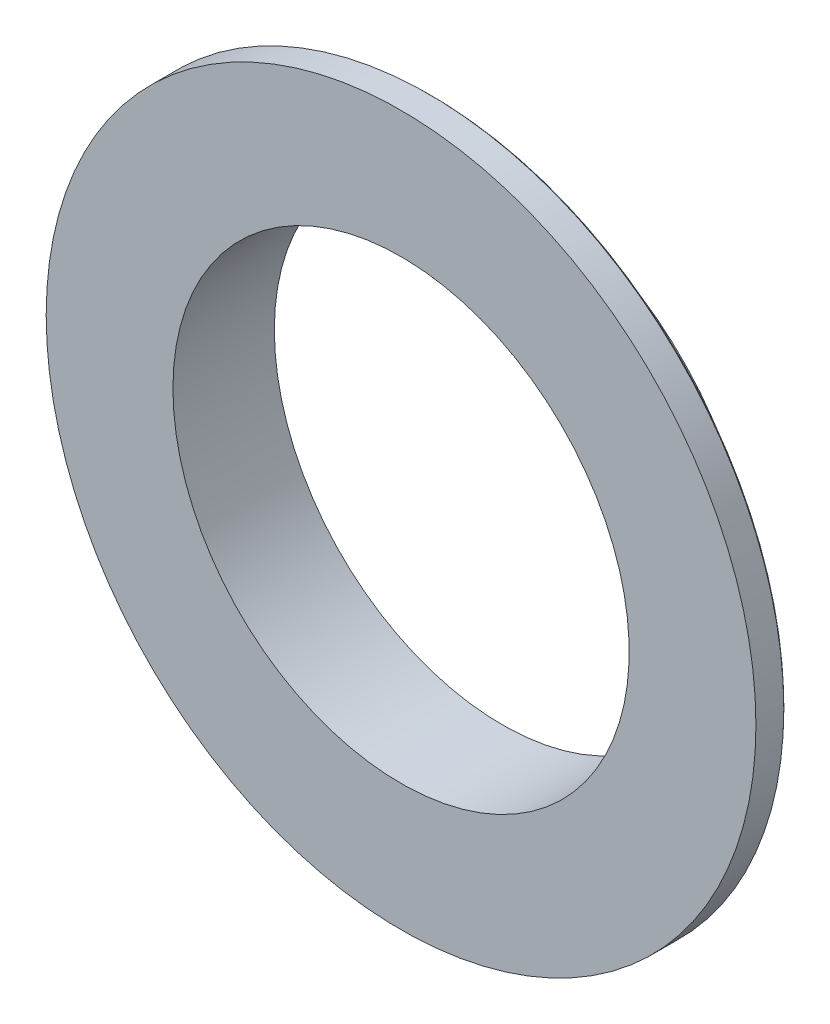
ISO-10303-21;
HEADER;
FILE_DESCRIPTION(('STEP AP214'),'2;1');
FILE_NAME('part.step','',(''),(''),'','','');
FILE_SCHEMA(('AUTOMOTIVE_DESIGN { 1 0 10303 214 1 1 1 1 }'));
ENDSEC;
DATA;
#1=APPLICATION_CONTEXT('core data for automotive mechanical design processes');
#2=APPLICATION_PROTOCOL_DEFINITION('international standard','automotive_design',2000,#1);
#3=PRODUCT_CONTEXT('',#1,'mechanical');
#4=PRODUCT('Part','Part','',(#3));
#5=PRODUCT_RELATED_PRODUCT_CATEGORY('part','',(#4));
#6=PRODUCT_DEFINITION_FORMATION('','',#4);
#7=PRODUCT_DEFINITION_CONTEXT('part definition',#1,'design');
#8=PRODUCT_DEFINITION('design','',#6,#7);
#9=PRODUCT_DEFINITION_SHAPE('','',#8);
#10=(LENGTH_UNIT() NAMED_UNIT(*) SI_UNIT(.MILLI.,.METRE.));
#11=(NAMED_UNIT(*) PLANE_ANGLE_UNIT() SI_UNIT($,.RADIAN.));
#12=(NAMED_UNIT(*) SI_UNIT($,.STERADIAN.) SOLID_ANGLE_UNIT());
#13=UNCERTAINTY_MEASURE_WITH_UNIT(LENGTH_MEASURE(1.E-05),#10,'distance_accuracy_value','');
#14=(GEOMETRIC_REPRESENTATION_CONTEXT(3) GLOBAL_UNCERTAINTY_ASSIGNED_CONTEXT((#13)) GLOBAL_UNIT_ASSIGNED_CONTEXT((#10,
#11,#12)) REPRESENTATION_CONTEXT('',''));
#15=CARTESIAN_POINT('',(0.,0.,0.));
#16=DIRECTION('',(0.,0.,1.));
#17=DIRECTION('',(1.,0.,0.));
#18=AXIS2_PLACEMENT_3D('',#15,#16,#17);
#19=CARTESIAN_POINT('',(0.,0.,20.));
#20=DIRECTION('',(0.,0.,-1.));
#21=DIRECTION('',(-1.,0.,0.));
#22=AXIS2_PLACEMENT_3D('',#19,#20,#21);
#23=CYLINDRICAL_SURFACE('',#22,70.);
#24=CARTESIAN_POINT('',(0.,0.,14.5));
#25=DIRECTION('',(0.,0.,-1.));
#26=DIRECTION('',(-1.,0.,0.));
#27=AXIS2_PLACEMENT_3D('',#24,#25,#26);
#28=CIRCLE('',#27,70.);
#29=CARTESIAN_POINT('',(-70.,0.,14.5));
#30=VERTEX_POINT('',#29);
#31=EDGE_CURVE('E12',#30,#30,#28,.F.);
#32=ORIENTED_EDGE('',*,*,#31,.T.);
#33=EDGE_LOOP('',(#32));
#34=FACE_BOUND('',#33,.T.);
#35=CARTESIAN_POINT('',(0.,0.,20.));
#36=DIRECTION('',(0.,0.,1.));
#37=DIRECTION('',(1.,0.,0.));
#38=AXIS2_PLACEMENT_3D('',#35,#36,#37);
#39=CIRCLE('',#38,70.);
#40=CARTESIAN_POINT('',(70.,0.,20.));
#41=VERTEX_POINT('',#40);
#42=EDGE_CURVE('E115',#41,#41,#39,.T.);
#43=ORIENTED_EDGE('',*,*,#42,.F.);
#44=EDGE_LOOP('',(#43));
#45=FACE_BOUND('',#44,.T.);
#46=ADVANCED_FACE('F34',(#34,#45),#23,.T.);
#47=CARTESIAN_POINT('',(0.,0.,20.));
#48=DIRECTION('',(0.,0.,1.));
#49=DIRECTION('',(1.,0.,0.));
#50=AXIS2_PLACEMENT_3D('',#47,#48,#49);
#51=PLANE('',#50);
#52=CARTESIAN_POINT('',(0.,0.,20.));
#53=DIRECTION('',(0.,0.,-1.));
#54=DIRECTION('',(-1.,0.,0.));
#55=AXIS2_PLACEMENT_3D('',#52,#53,#54);
#56=CIRCLE('',#55,45.);
#57=CARTESIAN_POINT('',(-45.,0.,20.));
#58=VERTEX_POINT('',#57);
#59=EDGE_CURVE('E107',#58,#58,#56,.T.);
#60=ORIENTED_EDGE('',*,*,#59,.T.);
#61=EDGE_LOOP('',(#60));
#62=FACE_BOUND('',#61,.T.);
#63=ORIENTED_EDGE('',*,*,#42,.T.);
#64=EDGE_LOOP('',(#63));
#65=FACE_BOUND('',#64,.T.);
#66=ADVANCED_FACE('F143',(#62,#65),#51,.T.);
#67=CARTESIAN_POINT('',(0.,0.,14.));
#68=DIRECTION('',(0.,0.,-1.));
#69=DIRECTION('',(-1.,0.,0.));
#70=AXIS2_PLACEMENT_3D('',#67,#68,#69);
#71=PLANE('',#70);
#72=CARTESIAN_POINT('',(0.,0.,14.));
#73=DIRECTION('',(0.,0.,-1.));
#74=DIRECTION('',(-1.,0.,0.));
#75=AXIS2_PLACEMENT_3D('',#72,#73,#74);
#76=CIRCLE('',#75,69.5);
#77=CARTESIAN_POINT('',(-69.5,0.,14.));
#78=VERTEX_POINT('',#77);
#79=EDGE_CURVE('E42',#78,#78,#76,.T.);
#80=ORIENTED_EDGE('',*,*,#79,.T.);
#81=EDGE_LOOP('',(#80));
#82=FACE_BOUND('',#81,.T.);
#83=CARTESIAN_POINT('',(0.,0.,14.));
#84=DIRECTION('',(0.,0.,-1.));
#85=DIRECTION('',(-1.,0.,0.));
#86=AXIS2_PLACEMENT_3D('',#83,#84,#85);
#87=CIRCLE('',#86,51.);
#88=CARTESIAN_POINT('',(-51.,0.,14.));
#89=VERTEX_POINT('',#88);
#90=EDGE_CURVE('E121',#89,#89,#87,.F.);
#91=ORIENTED_EDGE('',*,*,#90,.T.);
#92=EDGE_LOOP('',(#91));
#93=FACE_BOUND('',#92,.T.);
#94=ADVANCED_FACE('F126',(#82,#93),#71,.T.);
#95=CARTESIAN_POINT('',(0.,0.,14.));
#96=DIRECTION('',(0.,0.,-1.));
#97=DIRECTION('',(-1.,0.,0.));
#98=AXIS2_PLACEMENT_3D('',#95,#96,#97);
#99=CYLINDRICAL_SURFACE('',#98,50.);
#100=CARTESIAN_POINT('',(0.,0.,13.));
#101=DIRECTION('',(0.,0.,-1.));
#102=DIRECTION('',(-1.,0.,0.));
#103=AXIS2_PLACEMENT_3D('',#100,#101,#102);
#104=CIRCLE('',#103,50.);
#105=CARTESIAN_POINT('',(-50.,0.,13.));
#106=VERTEX_POINT('',#105);
#107=EDGE_CURVE('E118',#106,#106,#104,.T.);
#108=ORIENTED_EDGE('',*,*,#107,.T.);
#109=EDGE_LOOP('',(#108));
#110=FACE_BOUND('',#109,.T.);
#111=CARTESIAN_POINT('',(0.,0.,0.));
#112=DIRECTION('',(0.,0.,-1.));
#113=DIRECTION('',(-1.,0.,0.));
#114=AXIS2_PLACEMENT_3D('',#111,#112,#113);
#115=CIRCLE('',#114,50.);
#116=CARTESIAN_POINT('',(-50.,0.,0.));
#117=VERTEX_POINT('',#116);
#118=EDGE_CURVE('E110',#117,#117,#115,.T.);
#119=ORIENTED_EDGE('',*,*,#118,.F.);
#120=EDGE_LOOP('',(#119));
#121=FACE_BOUND('',#120,.T.);
#122=ADVANCED_FACE('F155',(#110,#121),#99,.T.);
#123=CARTESIAN_POINT('',(0.,0.,0.));
#124=DIRECTION('',(0.,0.,1.));
#125=DIRECTION('',(1.,0.,0.));
#126=AXIS2_PLACEMENT_3D('',#123,#124,#125);
#127=PLANE('',#126);
#128=CARTESIAN_POINT('',(-19.7219848567047,-43.4617823070424,0.));
#129=DIRECTION('',(0.,0.,-1.));
#130=DIRECTION('',(-1.,0.,0.));
#131=AXIS2_PLACEMENT_3D('',#128,#129,#130);
#132=CIRCLE('',#131,0.799999999999999);
#133=CARTESIAN_POINT('',(-20.5219848567046,-43.4617823070424,0.));
#134=VERTEX_POINT('',#133);
#135=EDGE_CURVE('E72',#134,#134,#132,.T.);
#136=ORIENTED_EDGE('',*,*,#135,.F.);
#137=EDGE_LOOP('',(#136));
#138=FACE_BOUND('',#137,.T.);
#139=CARTESIAN_POINT('',(27.7780151432955,-38.8106310524793,0.));
#140=DIRECTION('',(0.,0.,-1.));
#141=DIRECTION('',(-1.,0.,0.));
#142=AXIS2_PLACEMENT_3D('',#139,#140,#141);
#143=CIRCLE('',#142,0.799999999999999);
#144=CARTESIAN_POINT('',(26.9780151432955,-38.8106310524793,0.));
#145=VERTEX_POINT('',#144);
#146=EDGE_CURVE('E71',#145,#145,#143,.T.);
#147=ORIENTED_EDGE('',*,*,#146,.F.);
#148=EDGE_LOOP('',(#147));
#149=FACE_BOUND('',#148,.T.);
#150=CARTESIAN_POINT('',(47.5,4.6511512545635,0.));
#151=DIRECTION('',(0.,0.,-1.));
#152=DIRECTION('',(-1.,0.,0.));
#153=AXIS2_PLACEMENT_3D('',#150,#151,#152);
#154=CIRCLE('',#153,0.800000000000002);
#155=CARTESIAN_POINT('',(46.7,4.6511512545635,0.));
#156=VERTEX_POINT('',#155);
#157=EDGE_CURVE('E82',#156,#156,#154,.T.);
#158=ORIENTED_EDGE('',*,*,#157,.F.);
#159=EDGE_LOOP('',(#158));
#160=FACE_BOUND('',#159,.T.);
#161=CARTESIAN_POINT('',(19.7219848567044,43.4617823070425,0.));
#162=DIRECTION('',(0.,0.,-1.));
#163=DIRECTION('',(-1.,0.,0.));
#164=AXIS2_PLACEMENT_3D('',#161,#162,#163);
#165=CIRCLE('',#164,0.799999999999999);
#166=CARTESIAN_POINT('',(18.9219848567044,43.4617823070425,0.));
#167=VERTEX_POINT('',#166);
#168=EDGE_CURVE('E88',#167,#167,#165,.T.);
#169=ORIENTED_EDGE('',*,*,#168,.F.);
#170=EDGE_LOOP('',(#169));
#171=FACE_BOUND('',#170,.T.);
#172=CARTESIAN_POINT('',(-27.7780151432958,38.8106310524792,0.));
#173=DIRECTION('',(0.,0.,-1.));
#174=DIRECTION('',(-1.,0.,0.));
#175=AXIS2_PLACEMENT_3D('',#172,#173,#174);
#176=CIRCLE('',#175,0.799999999999999);
#177=CARTESIAN_POINT('',(-28.5780151432958,38.8106310524792,0.));
#178=VERTEX_POINT('',#177);
#179=EDGE_CURVE('E94',#178,#178,#176,.T.);
#180=ORIENTED_EDGE('',*,*,#179,.F.);
#181=EDGE_LOOP('',(#180));
#182=FACE_BOUND('',#181,.T.);
#183=CARTESIAN_POINT('',(-47.5,-4.6511512545635,0.));
#184=DIRECTION('',(0.,0.,-1.));
#185=DIRECTION('',(-1.,0.,0.));
#186=AXIS2_PLACEMENT_3D('',#183,#184,#185);
#187=CIRCLE('',#186,0.800000000000002);
#188=CARTESIAN_POINT('',(-48.3,-4.6511512545635,0.));
#189=VERTEX_POINT('',#188);
#190=EDGE_CURVE('E100',#189,#189,#187,.T.);
#191=ORIENTED_EDGE('',*,*,#190,.F.);
#192=EDGE_LOOP('',(#191));
#193=FACE_BOUND('',#192,.T.);
#194=CARTESIAN_POINT('',(0.,0.,0.));
#195=DIRECTION('',(0.,0.,-1.));
#196=DIRECTION('',(-1.,0.,0.));
#197=AXIS2_PLACEMENT_3D('',#194,#195,#196);
#198=CIRCLE('',#197,45.);
#199=CARTESIAN_POINT('',(-45.,0.,0.));
#200=VERTEX_POINT('',#199);
#201=EDGE_CURVE('E106',#200,#200,#198,.T.);
#202=ORIENTED_EDGE('',*,*,#201,.F.);
#203=EDGE_LOOP('',(#202));
#204=FACE_BOUND('',#203,.T.);
#205=ORIENTED_EDGE('',*,*,#118,.T.);
#206=EDGE_LOOP('',(#205));
#207=FACE_BOUND('',#206,.T.);
#208=ADVANCED_FACE('F153',(#138,#149,#160,#171,#182,#193,#204,#207),#127,.F.);
#209=CARTESIAN_POINT('',(0.,0.,20.));
#210=DIRECTION('',(0.,0.,-1.));
#211=DIRECTION('',(-1.,0.,0.));
#212=AXIS2_PLACEMENT_3D('',#209,#210,#211);
#213=CYLINDRICAL_SURFACE('',#212,45.);
#214=ORIENTED_EDGE('',*,*,#59,.F.);
#215=EDGE_LOOP('',(#214));
#216=FACE_BOUND('',#215,.T.);
#217=ORIENTED_EDGE('',*,*,#201,.T.);
#218=EDGE_LOOP('',(#217));
#219=FACE_BOUND('',#218,.T.);
#220=ADVANCED_FACE('F139',(#216,#219),#213,.F.);
#221=CARTESIAN_POINT('',(0.,0.,13.));
#222=DIRECTION('',(0.,0.,-1.));
#223=DIRECTION('',(-1.,0.,0.));
#224=AXIS2_PLACEMENT_3D('',#221,#222,#223);
#225=TOROIDAL_SURFACE('',#224,51.,1.);
#226=ORIENTED_EDGE('',*,*,#90,.F.);
#227=EDGE_LOOP('',(#226));
#228=FACE_BOUND('',#227,.T.);
#229=ORIENTED_EDGE('',*,*,#107,.F.);
#230=EDGE_LOOP('',(#229));
#231=FACE_BOUND('',#230,.T.);
#232=ADVANCED_FACE('F131',(#228,#231),#225,.F.);
#233=CARTESIAN_POINT('',(0.,0.,14.));
#234=DIRECTION('',(0.,0.,1.));
#235=DIRECTION('',(1.,0.,0.));
#236=AXIS2_PLACEMENT_3D('',#233,#234,#235);
#237=CONICAL_SURFACE('',#236,69.5,0.785398163397476);
#238=ORIENTED_EDGE('',*,*,#31,.F.);
#239=EDGE_LOOP('',(#238));
#240=FACE_BOUND('',#239,.T.);
#241=ORIENTED_EDGE('',*,*,#79,.F.);
#242=EDGE_LOOP('',(#241));
#243=FACE_BOUND('',#242,.T.);
#244=ADVANCED_FACE('F36',(#240,#243),#237,.T.);
#245=CARTESIAN_POINT('',(-47.5,-4.6511512545635,10.));
#246=DIRECTION('',(0.,0.,-1.));
#247=DIRECTION('',(-1.,0.,0.));
#248=AXIS2_PLACEMENT_3D('',#245,#246,#247);
#249=CONICAL_SURFACE('',#248,0.799999999999995,1.02974425867665);
#250=CARTESIAN_POINT('',(-47.5,-4.6511512545635,10.480688495222));
#251=VERTEX_POINT('',#250);
#252=VERTEX_LOOP('',#251);
#253=FACE_BOUND('',#252,.T.);
#254=CARTESIAN_POINT('',(-47.5,-4.6511512545635,10.));
#255=DIRECTION('',(0.,0.,-1.));
#256=DIRECTION('',(-1.,0.,0.));
#257=AXIS2_PLACEMENT_3D('',#254,#255,#256);
#258=CIRCLE('',#257,0.799999999999995);
#259=CARTESIAN_POINT('',(-48.3,-4.6511512545635,10.));
#260=VERTEX_POINT('',#259);
#261=EDGE_CURVE('E103',#260,#260,#258,.T.);
#262=ORIENTED_EDGE('',*,*,#261,.T.);
#263=EDGE_LOOP('',(#262));
#264=FACE_BOUND('',#263,.T.);
#265=ADVANCED_FACE('F130',(#253,#264),#249,.F.);
#266=CARTESIAN_POINT('',(-47.5,-4.6511512545635,0.));
#267=DIRECTION('',(0.,0.,-1.));
#268=DIRECTION('',(-1.,0.,0.));
#269=AXIS2_PLACEMENT_3D('',#266,#267,#268);
#270=CYLINDRICAL_SURFACE('',#269,0.799999999999999);
#271=ORIENTED_EDGE('',*,*,#261,.F.);
#272=EDGE_LOOP('',(#271));
#273=FACE_BOUND('',#272,.T.);
#274=ORIENTED_EDGE('',*,*,#190,.T.);
#275=EDGE_LOOP('',(#274));
#276=FACE_BOUND('',#275,.T.);
#277=ADVANCED_FACE('F137',(#273,#276),#270,.F.);
#278=CARTESIAN_POINT('',(-27.7780151432958,38.8106310524792,10.));
#279=DIRECTION('',(0.,0.,-1.));
#280=DIRECTION('',(-1.,0.,0.));
#281=AXIS2_PLACEMENT_3D('',#278,#279,#280);
#282=CONICAL_SURFACE('',#281,0.799999999999999,1.02974425867665);
#283=CARTESIAN_POINT('',(-27.7780151432958,38.8106310524792,10.480688495222));
#284=VERTEX_POINT('',#283);
#285=VERTEX_LOOP('',#284);
#286=FACE_BOUND('',#285,.T.);
#287=CARTESIAN_POINT('',(-27.7780151432958,38.8106310524792,10.));
#288=DIRECTION('',(0.,0.,-1.));
#289=DIRECTION('',(-1.,0.,0.));
#290=AXIS2_PLACEMENT_3D('',#287,#288,#289);
#291=CIRCLE('',#290,0.799999999999999);
#292=CARTESIAN_POINT('',(-28.5780151432958,38.8106310524792,10.));
#293=VERTEX_POINT('',#292);
#294=EDGE_CURVE('E97',#293,#293,#291,.T.);
#295=ORIENTED_EDGE('',*,*,#294,.T.);
#296=EDGE_LOOP('',(#295));
#297=FACE_BOUND('',#296,.T.);
#298=ADVANCED_FACE('F168',(#286,#297),#282,.F.);
#299=CARTESIAN_POINT('',(-27.7780151432958,38.8106310524792,0.));
#300=DIRECTION('',(0.,0.,-1.));
#301=DIRECTION('',(-1.,0.,0.));
#302=AXIS2_PLACEMENT_3D('',#299,#300,#301);
#303=CYLINDRICAL_SURFACE('',#302,0.799999999999999);
#304=ORIENTED_EDGE('',*,*,#294,.F.);
#305=EDGE_LOOP('',(#304));
#306=FACE_BOUND('',#305,.T.);
#307=ORIENTED_EDGE('',*,*,#179,.T.);
#308=EDGE_LOOP('',(#307));
#309=FACE_BOUND('',#308,.T.);
#310=ADVANCED_FACE('F172',(#306,#309),#303,.F.);
#311=CARTESIAN_POINT('',(19.7219848567044,43.4617823070425,10.));
#312=DIRECTION('',(0.,0.,-1.));
#313=DIRECTION('',(-1.,0.,0.));
#314=AXIS2_PLACEMENT_3D('',#311,#312,#313);
#315=CONICAL_SURFACE('',#314,0.799999999999999,1.02974425867665);
#316=CARTESIAN_POINT('',(19.7219848567043,43.4617823070425,10.480688495222));
#317=VERTEX_POINT('',#316);
#318=VERTEX_LOOP('',#317);
#319=FACE_BOUND('',#318,.T.);
#320=CARTESIAN_POINT('',(19.7219848567044,43.4617823070425,10.));
#321=DIRECTION('',(0.,0.,-1.));
#322=DIRECTION('',(-1.,0.,0.));
#323=AXIS2_PLACEMENT_3D('',#320,#321,#322);
#324=CIRCLE('',#323,0.799999999999999);
#325=CARTESIAN_POINT('',(18.9219848567044,43.4617823070425,10.));
#326=VERTEX_POINT('',#325);
#327=EDGE_CURVE('E91',#326,#326,#324,.T.);
#328=ORIENTED_EDGE('',*,*,#327,.T.);
#329=EDGE_LOOP('',(#328));
#330=FACE_BOUND('',#329,.T.);
#331=ADVANCED_FACE('F175',(#319,#330),#315,.F.);
#332=CARTESIAN_POINT('',(19.7219848567044,43.4617823070425,0.));
#333=DIRECTION('',(0.,0.,-1.));
#334=DIRECTION('',(-1.,0.,0.));
#335=AXIS2_PLACEMENT_3D('',#332,#333,#334);
#336=CYLINDRICAL_SURFACE('',#335,0.799999999999999);
#337=ORIENTED_EDGE('',*,*,#327,.F.);
#338=EDGE_LOOP('',(#337));
#339=FACE_BOUND('',#338,.T.);
#340=ORIENTED_EDGE('',*,*,#168,.T.);
#341=EDGE_LOOP('',(#340));
#342=FACE_BOUND('',#341,.T.);
#343=ADVANCED_FACE('F179',(#339,#342),#336,.F.);
#344=CARTESIAN_POINT('',(47.5,4.6511512545635,10.));
#345=DIRECTION('',(0.,0.,-1.));
#346=DIRECTION('',(-1.,0.,0.));
#347=AXIS2_PLACEMENT_3D('',#344,#345,#346);
#348=CONICAL_SURFACE('',#347,0.799999999999995,1.02974425867665);
#349=CARTESIAN_POINT('',(47.5,4.6511512545635,10.480688495222));
#350=VERTEX_POINT('',#349);
#351=VERTEX_LOOP('',#350);
#352=FACE_BOUND('',#351,.T.);
#353=CARTESIAN_POINT('',(47.5,4.6511512545635,10.));
#354=DIRECTION('',(0.,0.,-1.));
#355=DIRECTION('',(-1.,0.,0.));
#356=AXIS2_PLACEMENT_3D('',#353,#354,#355);
#357=CIRCLE('',#356,0.799999999999995);
#358=CARTESIAN_POINT('',(46.7,4.6511512545635,10.));
#359=VERTEX_POINT('',#358);
#360=EDGE_CURVE('E85',#359,#359,#357,.T.);
#361=ORIENTED_EDGE('',*,*,#360,.T.);
#362=EDGE_LOOP('',(#361));
#363=FACE_BOUND('',#362,.T.);
#364=ADVANCED_FACE('F183',(#352,#363),#348,.F.);
#365=CARTESIAN_POINT('',(47.5,4.6511512545635,0.));
#366=DIRECTION('',(0.,0.,-1.));
#367=DIRECTION('',(-1.,0.,0.));
#368=AXIS2_PLACEMENT_3D('',#365,#366,#367);
#369=CYLINDRICAL_SURFACE('',#368,0.799999999999999);
#370=ORIENTED_EDGE('',*,*,#360,.F.);
#371=EDGE_LOOP('',(#370));
#372=FACE_BOUND('',#371,.T.);
#373=ORIENTED_EDGE('',*,*,#157,.T.);
#374=EDGE_LOOP('',(#373));
#375=FACE_BOUND('',#374,.T.);
#376=ADVANCED_FACE('F187',(#372,#375),#369,.F.);
#377=CARTESIAN_POINT('',(27.7780151432955,-38.8106310524793,10.));
#378=DIRECTION('',(0.,0.,-1.));
#379=DIRECTION('',(-1.,0.,0.));
#380=AXIS2_PLACEMENT_3D('',#377,#378,#379);
#381=CONICAL_SURFACE('',#380,0.799999999999999,1.02974425867665);
#382=CARTESIAN_POINT('',(27.7780151432955,-38.8106310524793,10.480688495222));
#383=VERTEX_POINT('',#382);
#384=VERTEX_LOOP('',#383);
#385=FACE_BOUND('',#384,.T.);
#386=CARTESIAN_POINT('',(27.7780151432955,-38.8106310524793,10.));
#387=DIRECTION('',(0.,0.,-1.));
#388=DIRECTION('',(-1.,0.,0.));
#389=AXIS2_PLACEMENT_3D('',#386,#387,#388);
#390=CIRCLE('',#389,0.799999999999999);
#391=CARTESIAN_POINT('',(26.9780151432955,-38.8106310524793,10.));
#392=VERTEX_POINT('',#391);
#393=EDGE_CURVE('E75',#392,#392,#390,.T.);
#394=ORIENTED_EDGE('',*,*,#393,.T.);
#395=EDGE_LOOP('',(#394));
#396=FACE_BOUND('',#395,.T.);
#397=ADVANCED_FACE('F191',(#385,#396),#381,.F.);
#398=CARTESIAN_POINT('',(27.7780151432955,-38.8106310524793,0.));
#399=DIRECTION('',(0.,0.,-1.));
#400=DIRECTION('',(-1.,0.,0.));
#401=AXIS2_PLACEMENT_3D('',#398,#399,#400);
#402=CYLINDRICAL_SURFACE('',#401,0.799999999999999);
#403=ORIENTED_EDGE('',*,*,#393,.F.);
#404=EDGE_LOOP('',(#403));
#405=FACE_BOUND('',#404,.T.);
#406=ORIENTED_EDGE('',*,*,#146,.T.);
#407=EDGE_LOOP('',(#406));
#408=FACE_BOUND('',#407,.T.);
#409=ADVANCED_FACE('F65',(#405,#408),#402,.F.);
#410=CARTESIAN_POINT('',(-19.7219848567047,-43.4617823070424,10.));
#411=DIRECTION('',(0.,0.,-1.));
#412=DIRECTION('',(-1.,0.,0.));
#413=AXIS2_PLACEMENT_3D('',#410,#411,#412);
#414=CONICAL_SURFACE('',#413,0.799999999999999,1.02974425867665);
#415=CARTESIAN_POINT('',(-19.7219848567047,-43.4617823070424,10.480688495222));
#416=VERTEX_POINT('',#415);
#417=VERTEX_LOOP('',#416);
#418=FACE_BOUND('',#417,.T.);
#419=CARTESIAN_POINT('',(-19.7219848567047,-43.4617823070424,10.));
#420=DIRECTION('',(0.,0.,-1.));
#421=DIRECTION('',(-1.,0.,0.));
#422=AXIS2_PLACEMENT_3D('',#419,#420,#421);
#423=CIRCLE('',#422,0.799999999999999);
#424=CARTESIAN_POINT('',(-20.5219848567046,-43.4617823070424,10.));
#425=VERTEX_POINT('',#424);
#426=EDGE_CURVE('E69',#425,#425,#423,.T.);
#427=ORIENTED_EDGE('',*,*,#426,.T.);
#428=EDGE_LOOP('',(#427));
#429=FACE_BOUND('',#428,.T.);
#430=ADVANCED_FACE('F61',(#418,#429),#414,.F.);
#431=CARTESIAN_POINT('',(-19.7219848567047,-43.4617823070424,0.));
#432=DIRECTION('',(0.,0.,-1.));
#433=DIRECTION('',(-1.,0.,0.));
#434=AXIS2_PLACEMENT_3D('',#431,#432,#433);
#435=CYLINDRICAL_SURFACE('',#434,0.799999999999999);
#436=ORIENTED_EDGE('',*,*,#426,.F.);
#437=EDGE_LOOP('',(#436));
#438=FACE_BOUND('',#437,.T.);
#439=ORIENTED_EDGE('',*,*,#135,.T.);
#440=EDGE_LOOP('',(#439));
#441=FACE_BOUND('',#440,.T.);
#442=ADVANCED_FACE('F64',(#438,#441),#435,.F.);
#443=CLOSED_SHELL('',(#46,#66,#94,#122,#208,#220,#232,#244,#265,#277,#298,#310,#331,#343,#364,
#376,#397,#409,#430,#442));
#444=MANIFOLD_SOLID_BREP('B2',#443);
#445=ADVANCED_BREP_SHAPE_REPRESENTATION('',(#18,#444),#14);
#446=SHAPE_DEFINITION_REPRESENTATION(#9,#445);
ENDSEC;
END-ISO-10303-21;
